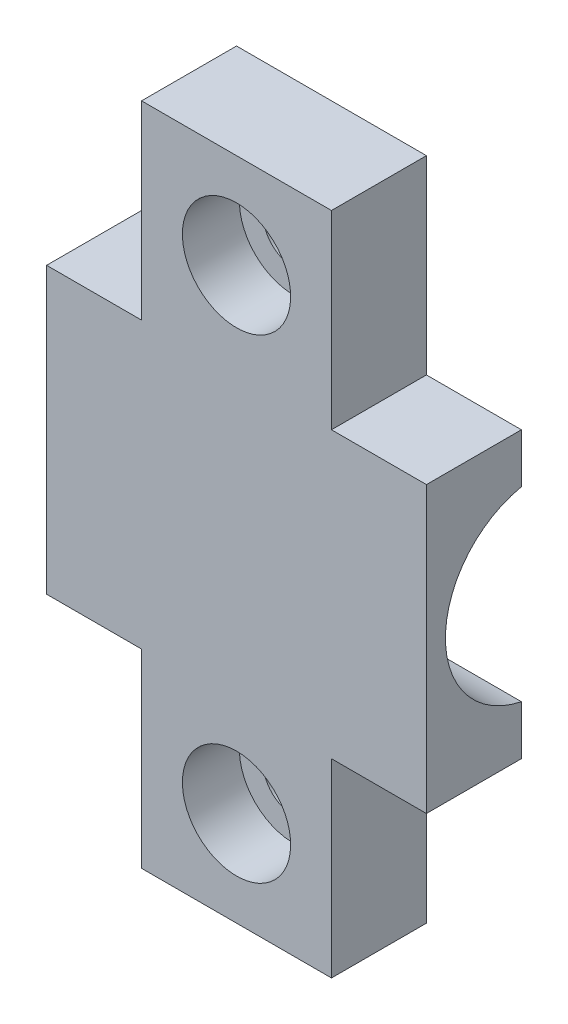
ISO-10303-21;
HEADER;
FILE_DESCRIPTION(('STEP AP214'),'2;1');
FILE_NAME('part.step','',(''),(''),'','','');
FILE_SCHEMA(('AUTOMOTIVE_DESIGN { 1 0 10303 214 1 1 1 1 }'));
ENDSEC;
DATA;
#1=APPLICATION_CONTEXT('core data for automotive mechanical design processes');
#2=APPLICATION_PROTOCOL_DEFINITION('international standard','automotive_design',2000,#1);
#3=PRODUCT_CONTEXT('',#1,'mechanical');
#4=PRODUCT('Part','Part','',(#3));
#5=PRODUCT_RELATED_PRODUCT_CATEGORY('part','',(#4));
#6=PRODUCT_DEFINITION_FORMATION('','',#4);
#7=PRODUCT_DEFINITION_CONTEXT('part definition',#1,'design');
#8=PRODUCT_DEFINITION('design','',#6,#7);
#9=PRODUCT_DEFINITION_SHAPE('','',#8);
#10=(LENGTH_UNIT() NAMED_UNIT(*) SI_UNIT(.MILLI.,.METRE.));
#11=(NAMED_UNIT(*) PLANE_ANGLE_UNIT() SI_UNIT($,.RADIAN.));
#12=(NAMED_UNIT(*) SI_UNIT($,.STERADIAN.) SOLID_ANGLE_UNIT());
#13=UNCERTAINTY_MEASURE_WITH_UNIT(LENGTH_MEASURE(1.E-05),#10,'distance_accuracy_value','');
#14=(GEOMETRIC_REPRESENTATION_CONTEXT(3) GLOBAL_UNCERTAINTY_ASSIGNED_CONTEXT((#13)) GLOBAL_UNIT_ASSIGNED_CONTEXT((#10,
#11,#12)) REPRESENTATION_CONTEXT('',''));
#15=CARTESIAN_POINT('',(0.,0.,0.));
#16=DIRECTION('',(0.,0.,1.));
#17=DIRECTION('',(1.,0.,0.));
#18=AXIS2_PLACEMENT_3D('',#15,#16,#17);
#19=CARTESIAN_POINT('',(10.,-12.5,0.999999999999997));
#20=DIRECTION('',(0.,0.,1.));
#21=DIRECTION('',(1.,0.,0.));
#22=AXIS2_PLACEMENT_3D('',#19,#20,#21);
#23=CYLINDRICAL_SURFACE('',#22,1.6);
#24=CARTESIAN_POINT('',(10.,-12.5,0.999999999999997));
#25=DIRECTION('',(0.,0.,1.));
#26=DIRECTION('',(1.,0.,0.));
#27=AXIS2_PLACEMENT_3D('',#24,#25,#26);
#28=CIRCLE('',#27,1.6);
#29=CARTESIAN_POINT('',(11.6,-12.5,0.999999999999997));
#30=VERTEX_POINT('',#29);
#31=EDGE_CURVE('E225',#30,#30,#28,.T.);
#32=ORIENTED_EDGE('',*,*,#31,.F.);
#33=EDGE_LOOP('',(#32));
#34=FACE_BOUND('',#33,.T.);
#35=CARTESIAN_POINT('',(10.,-12.5,3.));
#36=DIRECTION('',(0.,0.,1.));
#37=DIRECTION('',(1.,0.,0.));
#38=AXIS2_PLACEMENT_3D('',#35,#36,#37);
#39=CIRCLE('',#38,1.6);
#40=CARTESIAN_POINT('',(11.6,-12.5,3.));
#41=VERTEX_POINT('',#40);
#42=EDGE_CURVE('E205',#41,#41,#39,.T.);
#43=ORIENTED_EDGE('',*,*,#42,.T.);
#44=EDGE_LOOP('',(#43));
#45=FACE_BOUND('',#44,.T.);
#46=ADVANCED_FACE('F45',(#34,#45),#23,.F.);
#47=CARTESIAN_POINT('',(10.,12.5,0.999999999999997));
#48=DIRECTION('',(0.,0.,1.));
#49=DIRECTION('',(1.,0.,0.));
#50=AXIS2_PLACEMENT_3D('',#47,#48,#49);
#51=CYLINDRICAL_SURFACE('',#50,1.6);
#52=CARTESIAN_POINT('',(10.,12.5,0.999999999999997));
#53=DIRECTION('',(0.,0.,1.));
#54=DIRECTION('',(1.,0.,0.));
#55=AXIS2_PLACEMENT_3D('',#52,#53,#54);
#56=CIRCLE('',#55,1.6);
#57=CARTESIAN_POINT('',(11.6,12.5,0.999999999999997));
#58=VERTEX_POINT('',#57);
#59=EDGE_CURVE('E202',#58,#58,#56,.T.);
#60=ORIENTED_EDGE('',*,*,#59,.F.);
#61=EDGE_LOOP('',(#60));
#62=FACE_BOUND('',#61,.T.);
#63=CARTESIAN_POINT('',(10.,12.5,3.));
#64=DIRECTION('',(0.,0.,1.));
#65=DIRECTION('',(1.,0.,0.));
#66=AXIS2_PLACEMENT_3D('',#63,#64,#65);
#67=CIRCLE('',#66,1.6);
#68=CARTESIAN_POINT('',(11.6,12.5,3.));
#69=VERTEX_POINT('',#68);
#70=EDGE_CURVE('E216',#69,#69,#67,.T.);
#71=ORIENTED_EDGE('',*,*,#70,.T.);
#72=EDGE_LOOP('',(#71));
#73=FACE_BOUND('',#72,.T.);
#74=ADVANCED_FACE('F387',(#62,#73),#51,.F.);
#75=CARTESIAN_POINT('',(20.,0.,1.));
#76=DIRECTION('',(0.,0.,-1.));
#77=DIRECTION('',(0.,1.,0.));
#78=AXIS2_PLACEMENT_3D('',#75,#76,#77);
#79=PLANE('',#78);
#80=ORIENTED_EDGE('',*,*,#59,.T.);
#81=EDGE_LOOP('',(#80));
#82=FACE_BOUND('',#81,.T.);
#83=DIRECTION('',(1.,0.,0.));
#84=VECTOR('',#83,1.);
#85=CARTESIAN_POINT('',(0.,7.5,0.999999999999997));
#86=LINE('',#85,#84);
#87=CARTESIAN_POINT('',(0.,7.5,1.00000000000001));
#88=VERTEX_POINT('',#87);
#89=CARTESIAN_POINT('',(5.,7.5,0.999999999999997));
#90=VERTEX_POINT('',#89);
#91=EDGE_CURVE('E162',#88,#90,#86,.T.);
#92=ORIENTED_EDGE('',*,*,#91,.T.);
#93=DIRECTION('',(0.,-1.,0.));
#94=VECTOR('',#93,1.);
#95=CARTESIAN_POINT('',(5.,0.,0.999999999999997));
#96=LINE('',#95,#94);
#97=CARTESIAN_POINT('',(5.,17.5,0.999999999999997));
#98=VERTEX_POINT('',#97);
#99=EDGE_CURVE('E153',#98,#90,#96,.T.);
#100=ORIENTED_EDGE('',*,*,#99,.F.);
#101=DIRECTION('',(-1.,0.,0.));
#102=VECTOR('',#101,1.);
#103=CARTESIAN_POINT('',(20.,17.5,1.00000000000001));
#104=LINE('',#103,#102);
#105=CARTESIAN_POINT('',(15.,17.5,0.999999999999997));
#106=VERTEX_POINT('',#105);
#107=EDGE_CURVE('E169',#106,#98,#104,.T.);
#108=ORIENTED_EDGE('',*,*,#107,.F.);
#109=DIRECTION('',(0.,-1.,0.));
#110=VECTOR('',#109,1.);
#111=CARTESIAN_POINT('',(15.,0.,0.999999999999997));
#112=LINE('',#111,#110);
#113=CARTESIAN_POINT('',(15.,7.5,0.999999999999997));
#114=VERTEX_POINT('',#113);
#115=EDGE_CURVE('E234',#106,#114,#112,.T.);
#116=ORIENTED_EDGE('',*,*,#115,.T.);
#117=DIRECTION('',(-1.,0.,0.));
#118=VECTOR('',#117,1.);
#119=CARTESIAN_POINT('',(0.,7.5,0.999999999999997));
#120=LINE('',#119,#118);
#121=CARTESIAN_POINT('',(20.,7.5,0.999999999999997));
#122=VERTEX_POINT('',#121);
#123=EDGE_CURVE('E237',#122,#114,#120,.T.);
#124=ORIENTED_EDGE('',*,*,#123,.F.);
#125=DIRECTION('',(0.,-1.,0.));
#126=VECTOR('',#125,1.);
#127=CARTESIAN_POINT('',(20.,0.,1.));
#128=LINE('',#127,#126);
#129=CARTESIAN_POINT('',(20.,4.89897948556636,1.));
#130=VERTEX_POINT('',#129);
#131=EDGE_CURVE('E305',#122,#130,#128,.T.);
#132=ORIENTED_EDGE('',*,*,#131,.T.);
#133=DIRECTION('',(-1.,0.,0.));
#134=VECTOR('',#133,1.);
#135=CARTESIAN_POINT('',(20.,4.89897948556636,1.));
#136=LINE('',#135,#134);
#137=CARTESIAN_POINT('',(0.,4.89897948556636,1.));
#138=VERTEX_POINT('',#137);
#139=EDGE_CURVE('E178',#130,#138,#136,.T.);
#140=ORIENTED_EDGE('',*,*,#139,.T.);
#141=DIRECTION('',(0.,-1.,0.));
#142=VECTOR('',#141,1.);
#143=CARTESIAN_POINT('',(0.,0.,1.));
#144=LINE('',#143,#142);
#145=EDGE_CURVE('E320',#88,#138,#144,.T.);
#146=ORIENTED_EDGE('',*,*,#145,.F.);
#147=EDGE_LOOP('',(#92,#100,#108,#116,#124,#132,#140,#146));
#148=FACE_BOUND('',#147,.T.);
#149=ADVANCED_FACE('F167',(#82,#148),#79,.T.);
#150=CARTESIAN_POINT('',(20.,17.5,0.));
#151=DIRECTION('',(0.,-1.,0.));
#152=DIRECTION('',(0.,0.,-1.));
#153=AXIS2_PLACEMENT_3D('',#150,#151,#152);
#154=PLANE('',#153);
#155=DIRECTION('',(0.,0.,1.));
#156=VECTOR('',#155,1.);
#157=CARTESIAN_POINT('',(5.,17.5,0.999999999999997));
#158=LINE('',#157,#156);
#159=CARTESIAN_POINT('',(5.,17.5,6.00000000000001));
#160=VERTEX_POINT('',#159);
#161=EDGE_CURVE('E149',#98,#160,#158,.T.);
#162=ORIENTED_EDGE('',*,*,#161,.T.);
#163=DIRECTION('',(-1.,0.,0.));
#164=VECTOR('',#163,1.);
#165=CARTESIAN_POINT('',(20.,17.5,6.00000000000001));
#166=LINE('',#165,#164);
#167=CARTESIAN_POINT('',(15.,17.5,6.00000000000001));
#168=VERTEX_POINT('',#167);
#169=EDGE_CURVE('E179',#168,#160,#166,.T.);
#170=ORIENTED_EDGE('',*,*,#169,.F.);
#171=DIRECTION('',(0.,0.,1.));
#172=VECTOR('',#171,1.);
#173=CARTESIAN_POINT('',(15.,17.5,0.999999999999997));
#174=LINE('',#173,#172);
#175=EDGE_CURVE('E176',#106,#168,#174,.T.);
#176=ORIENTED_EDGE('',*,*,#175,.F.);
#177=ORIENTED_EDGE('',*,*,#107,.T.);
#178=EDGE_LOOP('',(#162,#170,#176,#177));
#179=FACE_BOUND('',#178,.T.);
#180=ADVANCED_FACE('F175',(#179),#154,.F.);
#181=CARTESIAN_POINT('',(20.,0.,6.));
#182=DIRECTION('',(0.,0.,-1.));
#183=DIRECTION('',(0.,1.,0.));
#184=AXIS2_PLACEMENT_3D('',#181,#182,#183);
#185=PLANE('',#184);
#186=CARTESIAN_POINT('',(10.,-12.5,6.));
#187=DIRECTION('',(0.,0.,-1.));
#188=DIRECTION('',(0.,1.,0.));
#189=AXIS2_PLACEMENT_3D('',#186,#187,#188);
#190=CIRCLE('',#189,2.85);
#191=CARTESIAN_POINT('',(10.,-9.65,6.));
#192=VERTEX_POINT('',#191);
#193=EDGE_CURVE('E49',#192,#192,#190,.F.);
#194=ORIENTED_EDGE('',*,*,#193,.F.);
#195=EDGE_LOOP('',(#194));
#196=FACE_BOUND('',#195,.T.);
#197=CARTESIAN_POINT('',(10.,12.5,6.00000000000001));
#198=DIRECTION('',(0.,0.,-1.));
#199=DIRECTION('',(0.,1.,0.));
#200=AXIS2_PLACEMENT_3D('',#197,#198,#199);
#201=CIRCLE('',#200,2.85);
#202=CARTESIAN_POINT('',(10.,15.35,6.00000000000001));
#203=VERTEX_POINT('',#202);
#204=EDGE_CURVE('E193',#203,#203,#201,.F.);
#205=ORIENTED_EDGE('',*,*,#204,.F.);
#206=EDGE_LOOP('',(#205));
#207=FACE_BOUND('',#206,.T.);
#208=DIRECTION('',(0.,1.,0.));
#209=VECTOR('',#208,1.);
#210=CARTESIAN_POINT('',(5.,0.,6.));
#211=LINE('',#210,#209);
#212=CARTESIAN_POINT('',(5.,7.5,6.00000000000001));
#213=VERTEX_POINT('',#212);
#214=EDGE_CURVE('E11',#213,#160,#211,.T.);
#215=ORIENTED_EDGE('',*,*,#214,.F.);
#216=DIRECTION('',(-1.,0.,0.));
#217=VECTOR('',#216,1.);
#218=CARTESIAN_POINT('',(20.,7.5,6.00000000000001));
#219=LINE('',#218,#217);
#220=CARTESIAN_POINT('',(0.,7.5,6.00000000000001));
#221=VERTEX_POINT('',#220);
#222=EDGE_CURVE('E283',#213,#221,#219,.T.);
#223=ORIENTED_EDGE('',*,*,#222,.T.);
#224=DIRECTION('',(0.,-1.,0.));
#225=VECTOR('',#224,1.);
#226=CARTESIAN_POINT('',(0.,0.,6.));
#227=LINE('',#226,#225);
#228=CARTESIAN_POINT('',(0.,-7.5,6.));
#229=VERTEX_POINT('',#228);
#230=EDGE_CURVE('E323',#221,#229,#227,.T.);
#231=ORIENTED_EDGE('',*,*,#230,.T.);
#232=DIRECTION('',(-1.,0.,0.));
#233=VECTOR('',#232,1.);
#234=CARTESIAN_POINT('',(20.,-7.5,6.));
#235=LINE('',#234,#233);
#236=CARTESIAN_POINT('',(5.,-7.5,6.));
#237=VERTEX_POINT('',#236);
#238=EDGE_CURVE('E274',#237,#229,#235,.T.);
#239=ORIENTED_EDGE('',*,*,#238,.F.);
#240=DIRECTION('',(0.,-1.,0.));
#241=VECTOR('',#240,1.);
#242=CARTESIAN_POINT('',(5.,0.,6.));
#243=LINE('',#242,#241);
#244=CARTESIAN_POINT('',(5.,-17.5,6.));
#245=VERTEX_POINT('',#244);
#246=EDGE_CURVE('E293',#237,#245,#243,.T.);
#247=ORIENTED_EDGE('',*,*,#246,.T.);
#248=DIRECTION('',(-1.,0.,0.));
#249=VECTOR('',#248,1.);
#250=CARTESIAN_POINT('',(20.,-17.5,6.));
#251=LINE('',#250,#249);
#252=CARTESIAN_POINT('',(15.,-17.5,6.));
#253=VERTEX_POINT('',#252);
#254=EDGE_CURVE('E187',#253,#245,#251,.T.);
#255=ORIENTED_EDGE('',*,*,#254,.F.);
#256=DIRECTION('',(0.,-1.,0.));
#257=VECTOR('',#256,1.);
#258=CARTESIAN_POINT('',(15.,0.,6.));
#259=LINE('',#258,#257);
#260=CARTESIAN_POINT('',(15.,-7.5,6.));
#261=VERTEX_POINT('',#260);
#262=EDGE_CURVE('E297',#261,#253,#259,.T.);
#263=ORIENTED_EDGE('',*,*,#262,.F.);
#264=DIRECTION('',(1.,0.,0.));
#265=VECTOR('',#264,1.);
#266=CARTESIAN_POINT('',(20.,-7.5,6.));
#267=LINE('',#266,#265);
#268=CARTESIAN_POINT('',(20.,-7.5,6.00000000000001));
#269=VERTEX_POINT('',#268);
#270=EDGE_CURVE('E287',#261,#269,#267,.T.);
#271=ORIENTED_EDGE('',*,*,#270,.T.);
#272=DIRECTION('',(0.,-1.,0.));
#273=VECTOR('',#272,1.);
#274=CARTESIAN_POINT('',(20.,0.,6.));
#275=LINE('',#274,#273);
#276=CARTESIAN_POINT('',(20.,7.5,6.00000000000001));
#277=VERTEX_POINT('',#276);
#278=EDGE_CURVE('E309',#277,#269,#275,.T.);
#279=ORIENTED_EDGE('',*,*,#278,.F.);
#280=DIRECTION('',(1.,0.,0.));
#281=VECTOR('',#280,1.);
#282=CARTESIAN_POINT('',(20.,7.5,6.00000000000001));
#283=LINE('',#282,#281);
#284=CARTESIAN_POINT('',(15.,7.5,6.00000000000001));
#285=VERTEX_POINT('',#284);
#286=EDGE_CURVE('E71',#285,#277,#283,.T.);
#287=ORIENTED_EDGE('',*,*,#286,.F.);
#288=DIRECTION('',(0.,1.,0.));
#289=VECTOR('',#288,1.);
#290=CARTESIAN_POINT('',(15.,0.,6.));
#291=LINE('',#290,#289);
#292=EDGE_CURVE('E55',#285,#168,#291,.T.);
#293=ORIENTED_EDGE('',*,*,#292,.T.);
#294=ORIENTED_EDGE('',*,*,#169,.T.);
#295=EDGE_LOOP('',(#215,#223,#231,#239,#247,#255,#263,#271,#279,#287,#293,#294));
#296=FACE_BOUND('',#295,.T.);
#297=ADVANCED_FACE('F344',(#196,#207,#296),#185,.F.);
#298=CARTESIAN_POINT('',(20.,-17.5,0.));
#299=DIRECTION('',(0.,-1.,0.));
#300=DIRECTION('',(0.,0.,-1.));
#301=AXIS2_PLACEMENT_3D('',#298,#299,#300);
#302=PLANE('',#301);
#303=DIRECTION('',(-1.,0.,0.));
#304=VECTOR('',#303,1.);
#305=CARTESIAN_POINT('',(20.,-17.5,0.999999999999998));
#306=LINE('',#305,#304);
#307=CARTESIAN_POINT('',(15.,-17.5,0.999999999999997));
#308=VERTEX_POINT('',#307);
#309=CARTESIAN_POINT('',(5.,-17.5,0.999999999999997));
#310=VERTEX_POINT('',#309);
#311=EDGE_CURVE('E332',#308,#310,#306,.T.);
#312=ORIENTED_EDGE('',*,*,#311,.F.);
#313=DIRECTION('',(0.,0.,1.));
#314=VECTOR('',#313,1.);
#315=CARTESIAN_POINT('',(15.,-17.5,0.999999999999997));
#316=LINE('',#315,#314);
#317=EDGE_CURVE('E251',#308,#253,#316,.T.);
#318=ORIENTED_EDGE('',*,*,#317,.T.);
#319=ORIENTED_EDGE('',*,*,#254,.T.);
#320=DIRECTION('',(0.,0.,1.));
#321=VECTOR('',#320,1.);
#322=CARTESIAN_POINT('',(5.,-17.5,0.999999999999997));
#323=LINE('',#322,#321);
#324=EDGE_CURVE('E270',#310,#245,#323,.T.);
#325=ORIENTED_EDGE('',*,*,#324,.F.);
#326=EDGE_LOOP('',(#312,#318,#319,#325));
#327=FACE_BOUND('',#326,.T.);
#328=ADVANCED_FACE('F341',(#327),#302,.T.);
#329=CARTESIAN_POINT('',(20.,0.,1.));
#330=DIRECTION('',(0.,0.,-1.));
#331=DIRECTION('',(0.,1.,0.));
#332=AXIS2_PLACEMENT_3D('',#329,#330,#331);
#333=PLANE('',#332);
#334=ORIENTED_EDGE('',*,*,#31,.T.);
#335=EDGE_LOOP('',(#334));
#336=FACE_BOUND('',#335,.T.);
#337=DIRECTION('',(-1.,0.,0.));
#338=VECTOR('',#337,1.);
#339=CARTESIAN_POINT('',(0.,-7.5,0.999999999999997));
#340=LINE('',#339,#338);
#341=CARTESIAN_POINT('',(20.,-7.5,1.));
#342=VERTEX_POINT('',#341);
#343=CARTESIAN_POINT('',(15.,-7.5,0.999999999999997));
#344=VERTEX_POINT('',#343);
#345=EDGE_CURVE('E63',#342,#344,#340,.T.);
#346=ORIENTED_EDGE('',*,*,#345,.T.);
#347=DIRECTION('',(0.,1.,0.));
#348=VECTOR('',#347,1.);
#349=CARTESIAN_POINT('',(15.,0.,0.999999999999997));
#350=LINE('',#349,#348);
#351=EDGE_CURVE('E246',#308,#344,#350,.T.);
#352=ORIENTED_EDGE('',*,*,#351,.F.);
#353=ORIENTED_EDGE('',*,*,#311,.T.);
#354=DIRECTION('',(0.,1.,0.));
#355=VECTOR('',#354,1.);
#356=CARTESIAN_POINT('',(5.,0.,0.999999999999997));
#357=LINE('',#356,#355);
#358=CARTESIAN_POINT('',(5.,-7.5,0.999999999999997));
#359=VERTEX_POINT('',#358);
#360=EDGE_CURVE('E231',#310,#359,#357,.T.);
#361=ORIENTED_EDGE('',*,*,#360,.T.);
#362=DIRECTION('',(1.,0.,0.));
#363=VECTOR('',#362,1.);
#364=CARTESIAN_POINT('',(0.,-7.5,0.999999999999997));
#365=LINE('',#364,#363);
#366=CARTESIAN_POINT('',(0.,-7.5,0.999999999999997));
#367=VERTEX_POINT('',#366);
#368=EDGE_CURVE('E267',#367,#359,#365,.T.);
#369=ORIENTED_EDGE('',*,*,#368,.F.);
#370=DIRECTION('',(0.,-1.,0.));
#371=VECTOR('',#370,1.);
#372=CARTESIAN_POINT('',(0.,0.,1.));
#373=LINE('',#372,#371);
#374=CARTESIAN_POINT('',(0.,-4.89897948556636,1.));
#375=VERTEX_POINT('',#374);
#376=EDGE_CURVE('E306',#375,#367,#373,.T.);
#377=ORIENTED_EDGE('',*,*,#376,.F.);
#378=DIRECTION('',(-1.,0.,0.));
#379=VECTOR('',#378,1.);
#380=CARTESIAN_POINT('',(20.,-4.89897948556636,1.));
#381=LINE('',#380,#379);
#382=CARTESIAN_POINT('',(20.,-4.89897948556636,1.));
#383=VERTEX_POINT('',#382);
#384=EDGE_CURVE('E316',#383,#375,#381,.T.);
#385=ORIENTED_EDGE('',*,*,#384,.F.);
#386=DIRECTION('',(0.,-1.,0.));
#387=VECTOR('',#386,1.);
#388=CARTESIAN_POINT('',(20.,0.,1.));
#389=LINE('',#388,#387);
#390=EDGE_CURVE('E312',#383,#342,#389,.T.);
#391=ORIENTED_EDGE('',*,*,#390,.T.);
#392=EDGE_LOOP('',(#346,#352,#353,#361,#369,#377,#385,#391));
#393=FACE_BOUND('',#392,.T.);
#394=ADVANCED_FACE('F354',(#336,#393),#333,.T.);
#395=CARTESIAN_POINT('',(20.,0.,0.));
#396=DIRECTION('',(1.,0.,0.));
#397=DIRECTION('',(0.,0.,-1.));
#398=AXIS2_PLACEMENT_3D('',#395,#396,#397);
#399=PLANE('',#398);
#400=ORIENTED_EDGE('',*,*,#131,.F.);
#401=DIRECTION('',(0.,0.,1.));
#402=VECTOR('',#401,1.);
#403=CARTESIAN_POINT('',(20.,7.5,0.999999999999997));
#404=LINE('',#403,#402);
#405=EDGE_CURVE('E172',#122,#277,#404,.T.);
#406=ORIENTED_EDGE('',*,*,#405,.T.);
#407=ORIENTED_EDGE('',*,*,#278,.T.);
#408=DIRECTION('',(0.,0.,1.));
#409=VECTOR('',#408,1.);
#410=CARTESIAN_POINT('',(20.,-7.5,0.999999999999997));
#411=LINE('',#410,#409);
#412=EDGE_CURVE('E255',#342,#269,#411,.T.);
#413=ORIENTED_EDGE('',*,*,#412,.F.);
#414=ORIENTED_EDGE('',*,*,#390,.F.);
#415=CARTESIAN_POINT('',(20.,0.,0.));
#416=DIRECTION('',(1.,0.,0.));
#417=DIRECTION('',(0.,0.,-1.));
#418=AXIS2_PLACEMENT_3D('',#415,#416,#417);
#419=CIRCLE('',#418,5.);
#420=EDGE_CURVE('E301',#130,#383,#419,.T.);
#421=ORIENTED_EDGE('',*,*,#420,.F.);
#422=EDGE_LOOP('',(#400,#406,#407,#413,#414,#421));
#423=FACE_BOUND('',#422,.T.);
#424=ADVANCED_FACE('F367',(#423),#399,.T.);
#425=CARTESIAN_POINT('',(0.,0.,0.));
#426=DIRECTION('',(1.,0.,0.));
#427=DIRECTION('',(0.,0.,-1.));
#428=AXIS2_PLACEMENT_3D('',#425,#426,#427);
#429=PLANE('',#428);
#430=ORIENTED_EDGE('',*,*,#230,.F.);
#431=DIRECTION('',(0.,0.,1.));
#432=VECTOR('',#431,1.);
#433=CARTESIAN_POINT('',(0.,7.5,0.999999999999997));
#434=LINE('',#433,#432);
#435=EDGE_CURVE('E161',#88,#221,#434,.T.);
#436=ORIENTED_EDGE('',*,*,#435,.F.);
#437=ORIENTED_EDGE('',*,*,#145,.T.);
#438=CARTESIAN_POINT('',(0.,0.,0.));
#439=DIRECTION('',(1.,0.,0.));
#440=DIRECTION('',(0.,0.,-1.));
#441=AXIS2_PLACEMENT_3D('',#438,#439,#440);
#442=CIRCLE('',#441,5.);
#443=EDGE_CURVE('E300',#138,#375,#442,.T.);
#444=ORIENTED_EDGE('',*,*,#443,.T.);
#445=ORIENTED_EDGE('',*,*,#376,.T.);
#446=DIRECTION('',(0.,0.,1.));
#447=VECTOR('',#446,1.);
#448=CARTESIAN_POINT('',(0.,-7.5,0.999999999999997));
#449=LINE('',#448,#447);
#450=EDGE_CURVE('E271',#367,#229,#449,.T.);
#451=ORIENTED_EDGE('',*,*,#450,.T.);
#452=EDGE_LOOP('',(#430,#436,#437,#444,#445,#451));
#453=FACE_BOUND('',#452,.T.);
#454=ADVANCED_FACE('F357',(#453),#429,.F.);
#455=CARTESIAN_POINT('',(20.,0.,0.));
#456=DIRECTION('',(-1.,0.,0.));
#457=DIRECTION('',(0.,0.,1.));
#458=AXIS2_PLACEMENT_3D('',#455,#456,#457);
#459=CYLINDRICAL_SURFACE('',#458,5.);
#460=ORIENTED_EDGE('',*,*,#443,.F.);
#461=ORIENTED_EDGE('',*,*,#139,.F.);
#462=ORIENTED_EDGE('',*,*,#420,.T.);
#463=ORIENTED_EDGE('',*,*,#384,.T.);
#464=EDGE_LOOP('',(#460,#461,#462,#463));
#465=FACE_BOUND('',#464,.T.);
#466=ADVANCED_FACE('F47',(#465),#459,.F.);
#467=CARTESIAN_POINT('',(5.,0.,0.999999999999997));
#468=DIRECTION('',(1.,0.,0.));
#469=DIRECTION('',(0.,0.,-1.));
#470=AXIS2_PLACEMENT_3D('',#467,#468,#469);
#471=PLANE('',#470);
#472=DIRECTION('',(0.,0.,1.));
#473=VECTOR('',#472,1.);
#474=CARTESIAN_POINT('',(5.,-7.5,0.999999999999997));
#475=LINE('',#474,#473);
#476=EDGE_CURVE('E275',#359,#237,#475,.T.);
#477=ORIENTED_EDGE('',*,*,#476,.F.);
#478=ORIENTED_EDGE('',*,*,#360,.F.);
#479=ORIENTED_EDGE('',*,*,#324,.T.);
#480=ORIENTED_EDGE('',*,*,#246,.F.);
#481=EDGE_LOOP('',(#477,#478,#479,#480));
#482=FACE_BOUND('',#481,.T.);
#483=ADVANCED_FACE('F348',(#482),#471,.F.);
#484=CARTESIAN_POINT('',(0.,-7.5,0.999999999999997));
#485=DIRECTION('',(0.,-1.,0.));
#486=DIRECTION('',(0.,0.,-1.));
#487=AXIS2_PLACEMENT_3D('',#484,#485,#486);
#488=PLANE('',#487);
#489=ORIENTED_EDGE('',*,*,#238,.T.);
#490=ORIENTED_EDGE('',*,*,#450,.F.);
#491=ORIENTED_EDGE('',*,*,#368,.T.);
#492=ORIENTED_EDGE('',*,*,#476,.T.);
#493=EDGE_LOOP('',(#489,#490,#491,#492));
#494=FACE_BOUND('',#493,.T.);
#495=ADVANCED_FACE('F350',(#494),#488,.T.);
#496=CARTESIAN_POINT('',(5.,0.,0.999999999999997));
#497=DIRECTION('',(-1.,0.,0.));
#498=DIRECTION('',(0.,0.,1.));
#499=AXIS2_PLACEMENT_3D('',#496,#497,#498);
#500=PLANE('',#499);
#501=ORIENTED_EDGE('',*,*,#214,.T.);
#502=ORIENTED_EDGE('',*,*,#161,.F.);
#503=ORIENTED_EDGE('',*,*,#99,.T.);
#504=DIRECTION('',(0.,0.,1.));
#505=VECTOR('',#504,1.);
#506=CARTESIAN_POINT('',(5.,7.5,0.999999999999997));
#507=LINE('',#506,#505);
#508=EDGE_CURVE('E228',#90,#213,#507,.T.);
#509=ORIENTED_EDGE('',*,*,#508,.T.);
#510=EDGE_LOOP('',(#501,#502,#503,#509));
#511=FACE_BOUND('',#510,.T.);
#512=ADVANCED_FACE('F151',(#511),#500,.T.);
#513=CARTESIAN_POINT('',(0.,7.5,0.999999999999997));
#514=DIRECTION('',(0.,-1.,0.));
#515=DIRECTION('',(0.,0.,-1.));
#516=AXIS2_PLACEMENT_3D('',#513,#514,#515);
#517=PLANE('',#516);
#518=ORIENTED_EDGE('',*,*,#508,.F.);
#519=ORIENTED_EDGE('',*,*,#91,.F.);
#520=ORIENTED_EDGE('',*,*,#435,.T.);
#521=ORIENTED_EDGE('',*,*,#222,.F.);
#522=EDGE_LOOP('',(#518,#519,#520,#521));
#523=FACE_BOUND('',#522,.T.);
#524=ADVANCED_FACE('F436',(#523),#517,.F.);
#525=CARTESIAN_POINT('',(15.,0.,0.999999999999997));
#526=DIRECTION('',(1.,0.,0.));
#527=DIRECTION('',(0.,0.,-1.));
#528=AXIS2_PLACEMENT_3D('',#525,#526,#527);
#529=PLANE('',#528);
#530=ORIENTED_EDGE('',*,*,#262,.T.);
#531=ORIENTED_EDGE('',*,*,#317,.F.);
#532=ORIENTED_EDGE('',*,*,#351,.T.);
#533=DIRECTION('',(0.,0.,1.));
#534=VECTOR('',#533,1.);
#535=CARTESIAN_POINT('',(15.,-7.5,0.999999999999997));
#536=LINE('',#535,#534);
#537=EDGE_CURVE('E238',#344,#261,#536,.T.);
#538=ORIENTED_EDGE('',*,*,#537,.T.);
#539=EDGE_LOOP('',(#530,#531,#532,#538));
#540=FACE_BOUND('',#539,.T.);
#541=ADVANCED_FACE('F398',(#540),#529,.T.);
#542=CARTESIAN_POINT('',(0.,-7.5,0.999999999999997));
#543=DIRECTION('',(0.,1.,0.));
#544=DIRECTION('',(0.,0.,1.));
#545=AXIS2_PLACEMENT_3D('',#542,#543,#544);
#546=PLANE('',#545);
#547=ORIENTED_EDGE('',*,*,#537,.F.);
#548=ORIENTED_EDGE('',*,*,#345,.F.);
#549=ORIENTED_EDGE('',*,*,#412,.T.);
#550=ORIENTED_EDGE('',*,*,#270,.F.);
#551=EDGE_LOOP('',(#547,#548,#549,#550));
#552=FACE_BOUND('',#551,.T.);
#553=ADVANCED_FACE('F369',(#552),#546,.F.);
#554=CARTESIAN_POINT('',(15.,0.,0.999999999999997));
#555=DIRECTION('',(-1.,0.,0.));
#556=DIRECTION('',(0.,-1.,0.));
#557=AXIS2_PLACEMENT_3D('',#554,#555,#556);
#558=PLANE('',#557);
#559=DIRECTION('',(0.,0.,1.));
#560=VECTOR('',#559,1.);
#561=CARTESIAN_POINT('',(15.,7.5,0.999999999999997));
#562=LINE('',#561,#560);
#563=EDGE_CURVE('E241',#114,#285,#562,.T.);
#564=ORIENTED_EDGE('',*,*,#563,.F.);
#565=ORIENTED_EDGE('',*,*,#115,.F.);
#566=ORIENTED_EDGE('',*,*,#175,.T.);
#567=ORIENTED_EDGE('',*,*,#292,.F.);
#568=EDGE_LOOP('',(#564,#565,#566,#567));
#569=FACE_BOUND('',#568,.T.);
#570=ADVANCED_FACE('F372',(#569),#558,.F.);
#571=CARTESIAN_POINT('',(0.,7.5,0.999999999999997));
#572=DIRECTION('',(0.,1.,0.));
#573=DIRECTION('',(0.,0.,1.));
#574=AXIS2_PLACEMENT_3D('',#571,#572,#573);
#575=PLANE('',#574);
#576=ORIENTED_EDGE('',*,*,#286,.T.);
#577=ORIENTED_EDGE('',*,*,#405,.F.);
#578=ORIENTED_EDGE('',*,*,#123,.T.);
#579=ORIENTED_EDGE('',*,*,#563,.T.);
#580=EDGE_LOOP('',(#576,#577,#578,#579));
#581=FACE_BOUND('',#580,.T.);
#582=ADVANCED_FACE('F373',(#581),#575,.T.);
#583=CARTESIAN_POINT('',(10.,12.5,6.000012));
#584=DIRECTION('',(0.,0.,-1.));
#585=DIRECTION('',(-1.,0.,0.));
#586=AXIS2_PLACEMENT_3D('',#583,#584,#585);
#587=CYLINDRICAL_SURFACE('',#586,2.85);
#588=CARTESIAN_POINT('',(10.,12.5,3.));
#589=DIRECTION('',(0.,0.,1.));
#590=DIRECTION('',(1.,0.,0.));
#591=AXIS2_PLACEMENT_3D('',#588,#589,#590);
#592=CIRCLE('',#591,2.85);
#593=CARTESIAN_POINT('',(12.85,12.5,3.));
#594=VERTEX_POINT('',#593);
#595=EDGE_CURVE('E213',#594,#594,#592,.T.);
#596=ORIENTED_EDGE('',*,*,#595,.F.);
#597=EDGE_LOOP('',(#596));
#598=FACE_BOUND('',#597,.T.);
#599=ORIENTED_EDGE('',*,*,#204,.T.);
#600=EDGE_LOOP('',(#599));
#601=FACE_BOUND('',#600,.T.);
#602=ADVANCED_FACE('F376',(#598,#601),#587,.F.);
#603=CARTESIAN_POINT('',(0.,0.,3.));
#604=DIRECTION('',(0.,0.,1.));
#605=DIRECTION('',(1.,0.,0.));
#606=AXIS2_PLACEMENT_3D('',#603,#604,#605);
#607=PLANE('',#606);
#608=ORIENTED_EDGE('',*,*,#70,.F.);
#609=EDGE_LOOP('',(#608));
#610=FACE_BOUND('',#609,.T.);
#611=ORIENTED_EDGE('',*,*,#595,.T.);
#612=EDGE_LOOP('',(#611));
#613=FACE_BOUND('',#612,.T.);
#614=ADVANCED_FACE('F381',(#610,#613),#607,.T.);
#615=CARTESIAN_POINT('',(10.,-12.5,6.000012));
#616=DIRECTION('',(0.,0.,-1.));
#617=DIRECTION('',(-1.,0.,0.));
#618=AXIS2_PLACEMENT_3D('',#615,#616,#617);
#619=CYLINDRICAL_SURFACE('',#618,2.85);
#620=CARTESIAN_POINT('',(10.,-12.5,3.));
#621=DIRECTION('',(0.,0.,1.));
#622=DIRECTION('',(1.,0.,0.));
#623=AXIS2_PLACEMENT_3D('',#620,#621,#622);
#624=CIRCLE('',#623,2.85);
#625=CARTESIAN_POINT('',(12.85,-12.5,3.));
#626=VERTEX_POINT('',#625);
#627=EDGE_CURVE('E196',#626,#626,#624,.T.);
#628=ORIENTED_EDGE('',*,*,#627,.F.);
#629=EDGE_LOOP('',(#628));
#630=FACE_BOUND('',#629,.T.);
#631=ORIENTED_EDGE('',*,*,#193,.T.);
#632=EDGE_LOOP('',(#631));
#633=FACE_BOUND('',#632,.T.);
#634=ADVANCED_FACE('F426',(#630,#633),#619,.F.);
#635=CARTESIAN_POINT('',(0.,0.,3.));
#636=DIRECTION('',(0.,0.,1.));
#637=DIRECTION('',(1.,0.,0.));
#638=AXIS2_PLACEMENT_3D('',#635,#636,#637);
#639=PLANE('',#638);
#640=ORIENTED_EDGE('',*,*,#42,.F.);
#641=EDGE_LOOP('',(#640));
#642=FACE_BOUND('',#641,.T.);
#643=ORIENTED_EDGE('',*,*,#627,.T.);
#644=EDGE_LOOP('',(#643));
#645=FACE_BOUND('',#644,.T.);
#646=ADVANCED_FACE('F431',(#642,#645),#639,.T.);
#647=CLOSED_SHELL('',(#46,#74,#149,#180,#297,#328,#394,#424,#454,#466,#483,#495,#512,#524,#541,
#553,#570,#582,#602,#614,#634,#646));
#648=MANIFOLD_SOLID_BREP('B2',#647);
#649=ADVANCED_BREP_SHAPE_REPRESENTATION('',(#18,#648),#14);
#650=SHAPE_DEFINITION_REPRESENTATION(#9,#649);
ENDSEC;
END-ISO-10303-21;
